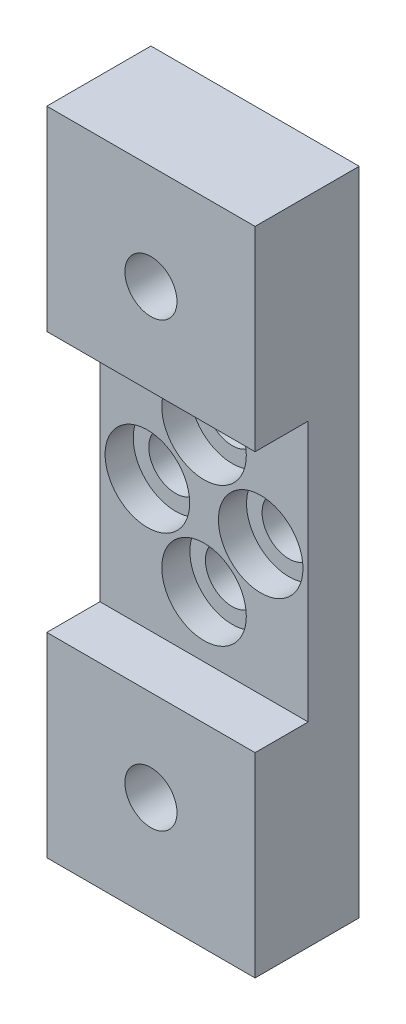
ISO-10303-21;
HEADER;
FILE_DESCRIPTION(('STEP AP214'),'2;1');
FILE_NAME('part.step','',(''),(''),'','','');
FILE_SCHEMA(('AUTOMOTIVE_DESIGN { 1 0 10303 214 1 1 1 1 }'));
ENDSEC;
DATA;
#1=APPLICATION_CONTEXT('core data for automotive mechanical design processes');
#2=APPLICATION_PROTOCOL_DEFINITION('international standard','automotive_design',2000,#1);
#3=PRODUCT_CONTEXT('',#1,'mechanical');
#4=PRODUCT('Part','Part','',(#3));
#5=PRODUCT_RELATED_PRODUCT_CATEGORY('part','',(#4));
#6=PRODUCT_DEFINITION_FORMATION('','',#4);
#7=PRODUCT_DEFINITION_CONTEXT('part definition',#1,'design');
#8=PRODUCT_DEFINITION('design','',#6,#7);
#9=PRODUCT_DEFINITION_SHAPE('','',#8);
#10=(LENGTH_UNIT() NAMED_UNIT(*) SI_UNIT(.MILLI.,.METRE.));
#11=(NAMED_UNIT(*) PLANE_ANGLE_UNIT() SI_UNIT($,.RADIAN.));
#12=(NAMED_UNIT(*) SI_UNIT($,.STERADIAN.) SOLID_ANGLE_UNIT());
#13=UNCERTAINTY_MEASURE_WITH_UNIT(LENGTH_MEASURE(1.E-05),#10,'distance_accuracy_value','');
#14=(GEOMETRIC_REPRESENTATION_CONTEXT(3) GLOBAL_UNCERTAINTY_ASSIGNED_CONTEXT((#13)) GLOBAL_UNIT_ASSIGNED_CONTEXT((#10,
#11,#12)) REPRESENTATION_CONTEXT('',''));
#15=CARTESIAN_POINT('',(0.,0.,0.));
#16=DIRECTION('',(0.,0.,1.));
#17=DIRECTION('',(1.,0.,0.));
#18=AXIS2_PLACEMENT_3D('',#15,#16,#17);
#19=CARTESIAN_POINT('',(-23.9833360824742,2.05986540664375,0.));
#20=DIRECTION('',(0.,0.,1.));
#21=DIRECTION('',(1.,0.,0.));
#22=AXIS2_PLACEMENT_3D('',#19,#20,#21);
#23=CYLINDRICAL_SURFACE('',#22,3.2639);
#24=CARTESIAN_POINT('',(-23.9833360824742,2.05986540664375,0.));
#25=DIRECTION('',(0.,0.,1.));
#26=DIRECTION('',(1.,0.,0.));
#27=AXIS2_PLACEMENT_3D('',#24,#25,#26);
#28=CIRCLE('',#27,3.2639);
#29=CARTESIAN_POINT('',(-20.7194360824742,2.05986540664375,0.));
#30=VERTEX_POINT('',#29);
#31=EDGE_CURVE('E218',#30,#30,#28,.T.);
#32=ORIENTED_EDGE('',*,*,#31,.F.);
#33=EDGE_LOOP('',(#32));
#34=FACE_BOUND('',#33,.T.);
#35=CARTESIAN_POINT('',(-23.9833360824742,2.05986540664375,2.794));
#36=DIRECTION('',(0.,0.,1.));
#37=DIRECTION('',(1.,0.,0.));
#38=AXIS2_PLACEMENT_3D('',#35,#36,#37);
#39=CIRCLE('',#38,3.2639);
#40=CARTESIAN_POINT('',(-20.7194360824742,2.05986540664375,2.794));
#41=VERTEX_POINT('',#40);
#42=EDGE_CURVE('E36',#41,#41,#39,.F.);
#43=ORIENTED_EDGE('',*,*,#42,.F.);
#44=EDGE_LOOP('',(#43));
#45=FACE_BOUND('',#44,.T.);
#46=ADVANCED_FACE('F32',(#34,#45),#23,.F.);
#47=CARTESIAN_POINT('',(-17.0745360824742,-6.43643459335625,0.));
#48=DIRECTION('',(0.,0.,1.));
#49=DIRECTION('',(1.,0.,0.));
#50=AXIS2_PLACEMENT_3D('',#47,#48,#49);
#51=CYLINDRICAL_SURFACE('',#50,3.2639);
#52=CARTESIAN_POINT('',(-17.0745360824742,-6.43643459335625,0.));
#53=DIRECTION('',(0.,0.,1.));
#54=DIRECTION('',(1.,0.,0.));
#55=AXIS2_PLACEMENT_3D('',#52,#53,#54);
#56=CIRCLE('',#55,3.2639);
#57=CARTESIAN_POINT('',(-13.8106360824742,-6.43643459335625,0.));
#58=VERTEX_POINT('',#57);
#59=EDGE_CURVE('E210',#58,#58,#56,.T.);
#60=ORIENTED_EDGE('',*,*,#59,.F.);
#61=EDGE_LOOP('',(#60));
#62=FACE_BOUND('',#61,.T.);
#63=CARTESIAN_POINT('',(-17.0745360824742,-6.43643459335625,2.794));
#64=DIRECTION('',(0.,0.,1.));
#65=DIRECTION('',(1.,0.,0.));
#66=AXIS2_PLACEMENT_3D('',#63,#64,#65);
#67=CIRCLE('',#66,3.2639);
#68=CARTESIAN_POINT('',(-13.8106360824742,-6.43643459335625,2.794));
#69=VERTEX_POINT('',#68);
#70=EDGE_CURVE('E176',#69,#69,#67,.F.);
#71=ORIENTED_EDGE('',*,*,#70,.F.);
#72=EDGE_LOOP('',(#71));
#73=FACE_BOUND('',#72,.T.);
#74=ADVANCED_FACE('F251',(#62,#73),#51,.F.);
#75=CARTESIAN_POINT('',(-10.1657360824742,2.05986540664375,0.));
#76=DIRECTION('',(0.,0.,1.));
#77=DIRECTION('',(1.,0.,0.));
#78=AXIS2_PLACEMENT_3D('',#75,#76,#77);
#79=CYLINDRICAL_SURFACE('',#78,3.2639);
#80=CARTESIAN_POINT('',(-10.1657360824742,2.05986540664375,0.));
#81=DIRECTION('',(0.,0.,1.));
#82=DIRECTION('',(1.,0.,0.));
#83=AXIS2_PLACEMENT_3D('',#80,#81,#82);
#84=CIRCLE('',#83,3.2639);
#85=CARTESIAN_POINT('',(-6.90183608247422,2.05986540664375,0.));
#86=VERTEX_POINT('',#85);
#87=EDGE_CURVE('E215',#86,#86,#84,.T.);
#88=ORIENTED_EDGE('',*,*,#87,.F.);
#89=EDGE_LOOP('',(#88));
#90=FACE_BOUND('',#89,.T.);
#91=CARTESIAN_POINT('',(-10.1657360824742,2.05986540664375,2.794));
#92=DIRECTION('',(0.,0.,1.));
#93=DIRECTION('',(1.,0.,0.));
#94=AXIS2_PLACEMENT_3D('',#91,#92,#93);
#95=CIRCLE('',#94,3.2639);
#96=CARTESIAN_POINT('',(-6.90183608247422,2.05986540664375,2.794));
#97=VERTEX_POINT('',#96);
#98=EDGE_CURVE('E172',#97,#97,#95,.F.);
#99=ORIENTED_EDGE('',*,*,#98,.F.);
#100=EDGE_LOOP('',(#99));
#101=FACE_BOUND('',#100,.T.);
#102=ADVANCED_FACE('F229',(#90,#101),#79,.F.);
#103=CARTESIAN_POINT('',(-17.0745360824742,10.5561654066437,0.));
#104=DIRECTION('',(0.,0.,1.));
#105=DIRECTION('',(1.,0.,0.));
#106=AXIS2_PLACEMENT_3D('',#103,#104,#105);
#107=CYLINDRICAL_SURFACE('',#106,3.2639);
#108=CARTESIAN_POINT('',(-17.0745360824742,10.5561654066437,0.));
#109=DIRECTION('',(0.,0.,1.));
#110=DIRECTION('',(1.,0.,0.));
#111=AXIS2_PLACEMENT_3D('',#108,#109,#110);
#112=CIRCLE('',#111,3.2639);
#113=CARTESIAN_POINT('',(-13.8106360824742,10.5561654066437,0.));
#114=VERTEX_POINT('',#113);
#115=EDGE_CURVE('E136',#114,#114,#112,.T.);
#116=ORIENTED_EDGE('',*,*,#115,.F.);
#117=EDGE_LOOP('',(#116));
#118=FACE_BOUND('',#117,.T.);
#119=CARTESIAN_POINT('',(-17.0745360824742,10.5561654066437,2.794));
#120=DIRECTION('',(0.,0.,1.));
#121=DIRECTION('',(1.,0.,0.));
#122=AXIS2_PLACEMENT_3D('',#119,#120,#121);
#123=CIRCLE('',#122,3.2639);
#124=CARTESIAN_POINT('',(-13.8106360824742,10.5561654066437,2.794));
#125=VERTEX_POINT('',#124);
#126=EDGE_CURVE('E167',#125,#125,#123,.F.);
#127=ORIENTED_EDGE('',*,*,#126,.F.);
#128=EDGE_LOOP('',(#127));
#129=FACE_BOUND('',#128,.T.);
#130=ADVANCED_FACE('F226',(#118,#129),#107,.F.);
#131=CARTESIAN_POINT('',(-29.7745360824742,41.7473654066437,12.7));
#132=DIRECTION('',(1.,0.,0.));
#133=DIRECTION('',(0.,1.,0.));
#134=AXIS2_PLACEMENT_3D('',#131,#132,#133);
#135=PLANE('',#134);
#136=DIRECTION('',(0.,0.,1.));
#137=VECTOR('',#136,1.);
#138=CARTESIAN_POINT('',(-29.7745360824742,17.9475654066438,6.223));
#139=LINE('',#138,#137);
#140=CARTESIAN_POINT('',(-29.7745360824742,17.9475654066438,6.223));
#141=VERTEX_POINT('',#140);
#142=CARTESIAN_POINT('',(-29.7745360824742,17.9475654066438,12.7));
#143=VERTEX_POINT('',#142);
#144=EDGE_CURVE('E108',#141,#143,#139,.T.);
#145=ORIENTED_EDGE('',*,*,#144,.T.);
#146=DIRECTION('',(0.,-1.,0.));
#147=VECTOR('',#146,1.);
#148=CARTESIAN_POINT('',(-29.7745360824742,41.7473654066437,12.7));
#149=LINE('',#148,#147);
#150=CARTESIAN_POINT('',(-29.7745360824742,41.7473654066437,12.7));
#151=VERTEX_POINT('',#150);
#152=EDGE_CURVE('E145',#151,#143,#149,.T.);
#153=ORIENTED_EDGE('',*,*,#152,.F.);
#154=DIRECTION('',(0.,0.,-1.));
#155=VECTOR('',#154,1.);
#156=CARTESIAN_POINT('',(-29.7745360824742,41.7473654066437,12.7));
#157=LINE('',#156,#155);
#158=CARTESIAN_POINT('',(-29.7745360824742,41.7473654066437,0.));
#159=VERTEX_POINT('',#158);
#160=EDGE_CURVE('E154',#151,#159,#157,.T.);
#161=ORIENTED_EDGE('',*,*,#160,.T.);
#162=DIRECTION('',(0.,-1.,0.));
#163=VECTOR('',#162,1.);
#164=CARTESIAN_POINT('',(-29.7745360824742,41.7473654066437,0.));
#165=LINE('',#164,#163);
#166=CARTESIAN_POINT('',(-29.7745360824742,-37.6276345933563,0.));
#167=VERTEX_POINT('',#166);
#168=EDGE_CURVE('E140',#159,#167,#165,.T.);
#169=ORIENTED_EDGE('',*,*,#168,.T.);
#170=DIRECTION('',(0.,0.,-1.));
#171=VECTOR('',#170,1.);
#172=CARTESIAN_POINT('',(-29.7745360824742,-37.6276345933563,12.7));
#173=LINE('',#172,#171);
#174=CARTESIAN_POINT('',(-29.7745360824742,-37.6276345933563,12.7));
#175=VERTEX_POINT('',#174);
#176=EDGE_CURVE('E11',#175,#167,#173,.T.);
#177=ORIENTED_EDGE('',*,*,#176,.F.);
#178=CARTESIAN_POINT('',(-29.7745360824742,-13.8278345933562,12.7));
#179=VERTEX_POINT('',#178);
#180=EDGE_CURVE('E86',#179,#175,#149,.T.);
#181=ORIENTED_EDGE('',*,*,#180,.F.);
#182=DIRECTION('',(0.,0.,1.));
#183=VECTOR('',#182,1.);
#184=CARTESIAN_POINT('',(-29.7745360824742,-13.8278345933563,6.223));
#185=LINE('',#184,#183);
#186=CARTESIAN_POINT('',(-29.7745360824742,-13.8278345933563,6.223));
#187=VERTEX_POINT('',#186);
#188=EDGE_CURVE('E49',#187,#179,#185,.T.);
#189=ORIENTED_EDGE('',*,*,#188,.F.);
#190=DIRECTION('',(0.,-1.,0.));
#191=VECTOR('',#190,1.);
#192=CARTESIAN_POINT('',(-29.7745360824742,0.,6.223));
#193=LINE('',#192,#191);
#194=EDGE_CURVE('E124',#141,#187,#193,.T.);
#195=ORIENTED_EDGE('',*,*,#194,.F.);
#196=EDGE_LOOP('',(#145,#153,#161,#169,#177,#181,#189,#195));
#197=FACE_BOUND('',#196,.T.);
#198=ADVANCED_FACE('F34',(#197),#135,.F.);
#199=CARTESIAN_POINT('',(-4.37453608247424,41.7473654066437,12.7));
#200=DIRECTION('',(-1.,0.,0.));
#201=DIRECTION('',(0.,-1.,0.));
#202=AXIS2_PLACEMENT_3D('',#199,#200,#201);
#203=PLANE('',#202);
#204=DIRECTION('',(0.,0.,1.));
#205=VECTOR('',#204,1.);
#206=CARTESIAN_POINT('',(-4.37453608247423,17.9475654066438,6.223));
#207=LINE('',#206,#205);
#208=CARTESIAN_POINT('',(-4.37453608247423,17.9475654066438,6.223));
#209=VERTEX_POINT('',#208);
#210=CARTESIAN_POINT('',(-4.37453608247423,17.9475654066438,12.7));
#211=VERTEX_POINT('',#210);
#212=EDGE_CURVE('E138',#209,#211,#207,.T.);
#213=ORIENTED_EDGE('',*,*,#212,.F.);
#214=DIRECTION('',(0.,1.,0.));
#215=VECTOR('',#214,1.);
#216=CARTESIAN_POINT('',(-4.37453608247423,0.,6.223));
#217=LINE('',#216,#215);
#218=CARTESIAN_POINT('',(-4.37453608247422,-13.8278345933563,6.223));
#219=VERTEX_POINT('',#218);
#220=EDGE_CURVE('E118',#219,#209,#217,.T.);
#221=ORIENTED_EDGE('',*,*,#220,.F.);
#222=DIRECTION('',(0.,0.,1.));
#223=VECTOR('',#222,1.);
#224=CARTESIAN_POINT('',(-4.37453608247422,-13.8278345933563,6.223));
#225=LINE('',#224,#223);
#226=CARTESIAN_POINT('',(-4.37453608247422,-13.8278345933563,12.7));
#227=VERTEX_POINT('',#226);
#228=EDGE_CURVE('E141',#219,#227,#225,.T.);
#229=ORIENTED_EDGE('',*,*,#228,.T.);
#230=DIRECTION('',(0.,1.,0.));
#231=VECTOR('',#230,1.);
#232=CARTESIAN_POINT('',(-4.37453608247424,41.7473654066437,12.7));
#233=LINE('',#232,#231);
#234=CARTESIAN_POINT('',(-4.37453608247422,-37.6276345933563,12.7));
#235=VERTEX_POINT('',#234);
#236=EDGE_CURVE('E150',#235,#227,#233,.T.);
#237=ORIENTED_EDGE('',*,*,#236,.F.);
#238=DIRECTION('',(0.,0.,-1.));
#239=VECTOR('',#238,1.);
#240=CARTESIAN_POINT('',(-4.37453608247422,-37.6276345933563,12.7));
#241=LINE('',#240,#239);
#242=CARTESIAN_POINT('',(-4.37453608247422,-37.6276345933563,0.));
#243=VERTEX_POINT('',#242);
#244=EDGE_CURVE('E41',#235,#243,#241,.T.);
#245=ORIENTED_EDGE('',*,*,#244,.T.);
#246=DIRECTION('',(0.,1.,0.));
#247=VECTOR('',#246,1.);
#248=CARTESIAN_POINT('',(-4.37453608247424,41.7473654066437,0.));
#249=LINE('',#248,#247);
#250=CARTESIAN_POINT('',(-4.37453608247424,41.7473654066437,0.));
#251=VERTEX_POINT('',#250);
#252=EDGE_CURVE('E159',#243,#251,#249,.T.);
#253=ORIENTED_EDGE('',*,*,#252,.T.);
#254=DIRECTION('',(0.,0.,-1.));
#255=VECTOR('',#254,1.);
#256=CARTESIAN_POINT('',(-4.37453608247424,41.7473654066437,12.7));
#257=LINE('',#256,#255);
#258=CARTESIAN_POINT('',(-4.37453608247424,41.7473654066437,12.7));
#259=VERTEX_POINT('',#258);
#260=EDGE_CURVE('E163',#259,#251,#257,.T.);
#261=ORIENTED_EDGE('',*,*,#260,.F.);
#262=EDGE_CURVE('E149',#211,#259,#233,.T.);
#263=ORIENTED_EDGE('',*,*,#262,.F.);
#264=EDGE_LOOP('',(#213,#221,#229,#237,#245,#253,#261,#263));
#265=FACE_BOUND('',#264,.T.);
#266=ADVANCED_FACE('F283',(#265),#203,.F.);
#267=CARTESIAN_POINT('',(-29.7745360824742,-37.6276345933563,12.7));
#268=DIRECTION('',(0.,0.,1.));
#269=DIRECTION('',(1.,0.,0.));
#270=AXIS2_PLACEMENT_3D('',#267,#268,#269);
#271=PLANE('',#270);
#272=CARTESIAN_POINT('',(-17.0745360824742,29.0473654066437,12.7));
#273=DIRECTION('',(0.,0.,1.));
#274=DIRECTION('',(1.,0.,0.));
#275=AXIS2_PLACEMENT_3D('',#272,#273,#274);
#276=CIRCLE('',#275,3.175);
#277=CARTESIAN_POINT('',(-13.8995360824742,29.0473654066437,12.7));
#278=VERTEX_POINT('',#277);
#279=EDGE_CURVE('E170',#278,#278,#276,.T.);
#280=ORIENTED_EDGE('',*,*,#279,.F.);
#281=EDGE_LOOP('',(#280));
#282=FACE_BOUND('',#281,.T.);
#283=ORIENTED_EDGE('',*,*,#152,.T.);
#284=DIRECTION('',(1.,0.,0.));
#285=VECTOR('',#284,1.);
#286=CARTESIAN_POINT('',(0.,17.9475654066438,12.7));
#287=LINE('',#286,#285);
#288=EDGE_CURVE('E114',#143,#211,#287,.T.);
#289=ORIENTED_EDGE('',*,*,#288,.T.);
#290=ORIENTED_EDGE('',*,*,#262,.T.);
#291=DIRECTION('',(-1.,0.,0.));
#292=VECTOR('',#291,1.);
#293=CARTESIAN_POINT('',(-29.7745360824742,41.7473654066437,12.7));
#294=LINE('',#293,#292);
#295=EDGE_CURVE('E58',#259,#151,#294,.T.);
#296=ORIENTED_EDGE('',*,*,#295,.T.);
#297=EDGE_LOOP('',(#283,#289,#290,#296));
#298=FACE_BOUND('',#297,.T.);
#299=ADVANCED_FACE('F276',(#282,#298),#271,.T.);
#300=CARTESIAN_POINT('',(-29.7745360824742,-37.6276345933563,12.7));
#301=DIRECTION('',(0.,1.,0.));
#302=DIRECTION('',(0.,0.,1.));
#303=AXIS2_PLACEMENT_3D('',#300,#301,#302);
#304=PLANE('',#303);
#305=DIRECTION('',(1.,0.,0.));
#306=VECTOR('',#305,1.);
#307=CARTESIAN_POINT('',(-29.7745360824742,-37.6276345933563,0.));
#308=LINE('',#307,#306);
#309=EDGE_CURVE('E157',#167,#243,#308,.T.);
#310=ORIENTED_EDGE('',*,*,#309,.T.);
#311=ORIENTED_EDGE('',*,*,#244,.F.);
#312=DIRECTION('',(1.,0.,0.));
#313=VECTOR('',#312,1.);
#314=CARTESIAN_POINT('',(-29.7745360824742,-37.6276345933563,12.7));
#315=LINE('',#314,#313);
#316=EDGE_CURVE('E147',#175,#235,#315,.T.);
#317=ORIENTED_EDGE('',*,*,#316,.F.);
#318=ORIENTED_EDGE('',*,*,#176,.T.);
#319=EDGE_LOOP('',(#310,#311,#317,#318));
#320=FACE_BOUND('',#319,.T.);
#321=ADVANCED_FACE('F282',(#320),#304,.F.);
#322=CARTESIAN_POINT('',(-29.7745360824742,41.7473654066437,12.7));
#323=DIRECTION('',(0.,-1.,0.));
#324=DIRECTION('',(0.,0.,-1.));
#325=AXIS2_PLACEMENT_3D('',#322,#323,#324);
#326=PLANE('',#325);
#327=DIRECTION('',(-1.,0.,0.));
#328=VECTOR('',#327,1.);
#329=CARTESIAN_POINT('',(-29.7745360824742,41.7473654066437,0.));
#330=LINE('',#329,#328);
#331=EDGE_CURVE('E79',#251,#159,#330,.T.);
#332=ORIENTED_EDGE('',*,*,#331,.T.);
#333=ORIENTED_EDGE('',*,*,#160,.F.);
#334=ORIENTED_EDGE('',*,*,#295,.F.);
#335=ORIENTED_EDGE('',*,*,#260,.T.);
#336=EDGE_LOOP('',(#332,#333,#334,#335));
#337=FACE_BOUND('',#336,.T.);
#338=ADVANCED_FACE('F274',(#337),#326,.F.);
#339=CARTESIAN_POINT('',(-17.0745360824742,-24.9276345933563,12.7));
#340=DIRECTION('',(0.,0.,1.));
#341=DIRECTION('',(1.,0.,0.));
#342=AXIS2_PLACEMENT_3D('',#339,#340,#341);
#343=CIRCLE('',#342,3.175);
#344=CARTESIAN_POINT('',(-13.8995360824742,-24.9276345933563,12.7));
#345=VERTEX_POINT('',#344);
#346=EDGE_CURVE('E204',#345,#345,#343,.T.);
#347=ORIENTED_EDGE('',*,*,#346,.F.);
#348=EDGE_LOOP('',(#347));
#349=FACE_BOUND('',#348,.T.);
#350=DIRECTION('',(1.,0.,0.));
#351=VECTOR('',#350,1.);
#352=CARTESIAN_POINT('',(0.,-13.8278345933563,12.7));
#353=LINE('',#352,#351);
#354=EDGE_CURVE('E127',#179,#227,#353,.T.);
#355=ORIENTED_EDGE('',*,*,#354,.F.);
#356=ORIENTED_EDGE('',*,*,#180,.T.);
#357=ORIENTED_EDGE('',*,*,#316,.T.);
#358=ORIENTED_EDGE('',*,*,#236,.T.);
#359=EDGE_LOOP('',(#355,#356,#357,#358));
#360=FACE_BOUND('',#359,.T.);
#361=ADVANCED_FACE('F271',(#349,#360),#271,.T.);
#362=CARTESIAN_POINT('',(-29.7745360824742,-37.6276345933563,0.));
#363=DIRECTION('',(0.,0.,1.));
#364=DIRECTION('',(1.,0.,0.));
#365=AXIS2_PLACEMENT_3D('',#362,#363,#364);
#366=PLANE('',#365);
#367=CARTESIAN_POINT('',(-17.0745360824742,29.0473654066437,0.));
#368=DIRECTION('',(0.,0.,1.));
#369=DIRECTION('',(1.,0.,0.));
#370=AXIS2_PLACEMENT_3D('',#367,#368,#369);
#371=CIRCLE('',#370,3.175);
#372=CARTESIAN_POINT('',(-13.8995360824742,29.0473654066437,0.));
#373=VERTEX_POINT('',#372);
#374=EDGE_CURVE('E201',#373,#373,#371,.T.);
#375=ORIENTED_EDGE('',*,*,#374,.T.);
#376=EDGE_LOOP('',(#375));
#377=FACE_BOUND('',#376,.T.);
#378=CARTESIAN_POINT('',(-17.0745360824742,-24.9276345933563,0.));
#379=DIRECTION('',(0.,0.,1.));
#380=DIRECTION('',(1.,0.,0.));
#381=AXIS2_PLACEMENT_3D('',#378,#379,#380);
#382=CIRCLE('',#381,3.175);
#383=CARTESIAN_POINT('',(-13.8995360824742,-24.9276345933563,0.));
#384=VERTEX_POINT('',#383);
#385=EDGE_CURVE('E207',#384,#384,#382,.T.);
#386=ORIENTED_EDGE('',*,*,#385,.T.);
#387=EDGE_LOOP('',(#386));
#388=FACE_BOUND('',#387,.T.);
#389=ORIENTED_EDGE('',*,*,#59,.T.);
#390=EDGE_LOOP('',(#389));
#391=FACE_BOUND('',#390,.T.);
#392=ORIENTED_EDGE('',*,*,#87,.T.);
#393=EDGE_LOOP('',(#392));
#394=FACE_BOUND('',#393,.T.);
#395=ORIENTED_EDGE('',*,*,#31,.T.);
#396=EDGE_LOOP('',(#395));
#397=FACE_BOUND('',#396,.T.);
#398=ORIENTED_EDGE('',*,*,#115,.T.);
#399=EDGE_LOOP('',(#398));
#400=FACE_BOUND('',#399,.T.);
#401=ORIENTED_EDGE('',*,*,#168,.F.);
#402=ORIENTED_EDGE('',*,*,#331,.F.);
#403=ORIENTED_EDGE('',*,*,#252,.F.);
#404=ORIENTED_EDGE('',*,*,#309,.F.);
#405=EDGE_LOOP('',(#401,#402,#403,#404));
#406=FACE_BOUND('',#405,.T.);
#407=ADVANCED_FACE('F223',(#377,#388,#391,#394,#397,#400,#406),#366,.F.);
#408=CARTESIAN_POINT('',(0.,17.9475654066438,6.223));
#409=DIRECTION('',(0.,-1.,0.));
#410=DIRECTION('',(0.,0.,-1.));
#411=AXIS2_PLACEMENT_3D('',#408,#409,#410);
#412=PLANE('',#411);
#413=ORIENTED_EDGE('',*,*,#288,.F.);
#414=ORIENTED_EDGE('',*,*,#144,.F.);
#415=DIRECTION('',(1.,0.,0.));
#416=VECTOR('',#415,1.);
#417=CARTESIAN_POINT('',(0.,17.9475654066438,6.223));
#418=LINE('',#417,#416);
#419=EDGE_CURVE('E111',#141,#209,#418,.T.);
#420=ORIENTED_EDGE('',*,*,#419,.T.);
#421=ORIENTED_EDGE('',*,*,#212,.T.);
#422=EDGE_LOOP('',(#413,#414,#420,#421));
#423=FACE_BOUND('',#422,.T.);
#424=ADVANCED_FACE('F110',(#423),#412,.T.);
#425=CARTESIAN_POINT('',(0.,-13.8278345933563,6.223));
#426=DIRECTION('',(0.,-1.,0.));
#427=DIRECTION('',(0.,0.,-1.));
#428=AXIS2_PLACEMENT_3D('',#425,#426,#427);
#429=PLANE('',#428);
#430=ORIENTED_EDGE('',*,*,#354,.T.);
#431=ORIENTED_EDGE('',*,*,#228,.F.);
#432=DIRECTION('',(1.,0.,0.));
#433=VECTOR('',#432,1.);
#434=CARTESIAN_POINT('',(0.,-13.8278345933563,6.223));
#435=LINE('',#434,#433);
#436=EDGE_CURVE('E129',#187,#219,#435,.T.);
#437=ORIENTED_EDGE('',*,*,#436,.F.);
#438=ORIENTED_EDGE('',*,*,#188,.T.);
#439=EDGE_LOOP('',(#430,#431,#437,#438));
#440=FACE_BOUND('',#439,.T.);
#441=ADVANCED_FACE('F265',(#440),#429,.F.);
#442=CARTESIAN_POINT('',(0.,0.,6.223));
#443=DIRECTION('',(0.,0.,1.));
#444=DIRECTION('',(1.,0.,0.));
#445=AXIS2_PLACEMENT_3D('',#442,#443,#444);
#446=PLANE('',#445);
#447=CARTESIAN_POINT('',(-23.9833360824742,2.05986540664375,6.223));
#448=DIRECTION('',(0.,0.,1.));
#449=DIRECTION('',(1.,0.,0.));
#450=AXIS2_PLACEMENT_3D('',#447,#448,#449);
#451=CIRCLE('',#450,5.1562);
#452=CARTESIAN_POINT('',(-18.8271360824742,2.05986540664375,6.223));
#453=VERTEX_POINT('',#452);
#454=EDGE_CURVE('E192',#453,#453,#451,.T.);
#455=ORIENTED_EDGE('',*,*,#454,.F.);
#456=EDGE_LOOP('',(#455));
#457=FACE_BOUND('',#456,.T.);
#458=CARTESIAN_POINT('',(-17.0745360824742,-6.43643459335625,6.223));
#459=DIRECTION('',(0.,0.,1.));
#460=DIRECTION('',(1.,0.,0.));
#461=AXIS2_PLACEMENT_3D('',#458,#459,#460);
#462=CIRCLE('',#461,5.1562);
#463=CARTESIAN_POINT('',(-11.9183360824742,-6.43643459335625,6.223));
#464=VERTEX_POINT('',#463);
#465=EDGE_CURVE('E185',#464,#464,#462,.T.);
#466=ORIENTED_EDGE('',*,*,#465,.F.);
#467=EDGE_LOOP('',(#466));
#468=FACE_BOUND('',#467,.T.);
#469=CARTESIAN_POINT('',(-10.1657360824742,2.05986540664375,6.223));
#470=DIRECTION('',(0.,0.,1.));
#471=DIRECTION('',(1.,0.,0.));
#472=AXIS2_PLACEMENT_3D('',#469,#470,#471);
#473=CIRCLE('',#472,5.1562);
#474=CARTESIAN_POINT('',(-5.00953608247422,2.05986540664375,6.223));
#475=VERTEX_POINT('',#474);
#476=EDGE_CURVE('E178',#475,#475,#473,.T.);
#477=ORIENTED_EDGE('',*,*,#476,.F.);
#478=EDGE_LOOP('',(#477));
#479=FACE_BOUND('',#478,.T.);
#480=CARTESIAN_POINT('',(-17.0745360824742,10.5561654066437,6.223));
#481=DIRECTION('',(0.,0.,1.));
#482=DIRECTION('',(1.,0.,0.));
#483=AXIS2_PLACEMENT_3D('',#480,#481,#482);
#484=CIRCLE('',#483,5.1562);
#485=CARTESIAN_POINT('',(-11.9183360824742,10.5561654066437,6.223));
#486=VERTEX_POINT('',#485);
#487=EDGE_CURVE('E174',#486,#486,#484,.T.);
#488=ORIENTED_EDGE('',*,*,#487,.F.);
#489=EDGE_LOOP('',(#488));
#490=FACE_BOUND('',#489,.T.);
#491=ORIENTED_EDGE('',*,*,#419,.F.);
#492=ORIENTED_EDGE('',*,*,#194,.T.);
#493=ORIENTED_EDGE('',*,*,#436,.T.);
#494=ORIENTED_EDGE('',*,*,#220,.T.);
#495=EDGE_LOOP('',(#491,#492,#493,#494));
#496=FACE_BOUND('',#495,.T.);
#497=ADVANCED_FACE('F122',(#457,#468,#479,#490,#496),#446,.T.);
#498=CARTESIAN_POINT('',(-17.0745360824742,-24.9276345933563,0.));
#499=DIRECTION('',(0.,0.,1.));
#500=DIRECTION('',(1.,0.,0.));
#501=AXIS2_PLACEMENT_3D('',#498,#499,#500);
#502=CYLINDRICAL_SURFACE('',#501,3.175);
#503=ORIENTED_EDGE('',*,*,#385,.F.);
#504=EDGE_LOOP('',(#503));
#505=FACE_BOUND('',#504,.T.);
#506=ORIENTED_EDGE('',*,*,#346,.T.);
#507=EDGE_LOOP('',(#506));
#508=FACE_BOUND('',#507,.T.);
#509=ADVANCED_FACE('F246',(#505,#508),#502,.F.);
#510=CARTESIAN_POINT('',(-17.0745360824742,29.0473654066437,0.));
#511=DIRECTION('',(0.,0.,1.));
#512=DIRECTION('',(1.,0.,0.));
#513=AXIS2_PLACEMENT_3D('',#510,#511,#512);
#514=CYLINDRICAL_SURFACE('',#513,3.175);
#515=ORIENTED_EDGE('',*,*,#374,.F.);
#516=EDGE_LOOP('',(#515));
#517=FACE_BOUND('',#516,.T.);
#518=ORIENTED_EDGE('',*,*,#279,.T.);
#519=EDGE_LOOP('',(#518));
#520=FACE_BOUND('',#519,.T.);
#521=ADVANCED_FACE('F236',(#517,#520),#514,.F.);
#522=CARTESIAN_POINT('',(-17.0745360824742,10.5561654066437,2.794));
#523=DIRECTION('',(0.,0.,1.));
#524=DIRECTION('',(1.,0.,0.));
#525=AXIS2_PLACEMENT_3D('',#522,#523,#524);
#526=PLANE('',#525);
#527=CARTESIAN_POINT('',(-17.0745360824742,10.5561654066437,2.794));
#528=DIRECTION('',(0.,0.,1.));
#529=DIRECTION('',(1.,0.,0.));
#530=AXIS2_PLACEMENT_3D('',#527,#528,#529);
#531=CIRCLE('',#530,5.1562);
#532=CARTESIAN_POINT('',(-11.9183360824742,10.5561654066437,2.794));
#533=VERTEX_POINT('',#532);
#534=EDGE_CURVE('E171',#533,#533,#531,.T.);
#535=ORIENTED_EDGE('',*,*,#534,.T.);
#536=EDGE_LOOP('',(#535));
#537=FACE_BOUND('',#536,.T.);
#538=ORIENTED_EDGE('',*,*,#126,.T.);
#539=EDGE_LOOP('',(#538));
#540=FACE_BOUND('',#539,.T.);
#541=ADVANCED_FACE('F233',(#537,#540),#526,.T.);
#542=CARTESIAN_POINT('',(-17.0745360824742,10.5561654066437,2.794));
#543=DIRECTION('',(0.,0.,1.));
#544=DIRECTION('',(1.,0.,0.));
#545=AXIS2_PLACEMENT_3D('',#542,#543,#544);
#546=CYLINDRICAL_SURFACE('',#545,5.1562);
#547=ORIENTED_EDGE('',*,*,#534,.F.);
#548=EDGE_LOOP('',(#547));
#549=FACE_BOUND('',#548,.T.);
#550=ORIENTED_EDGE('',*,*,#487,.T.);
#551=EDGE_LOOP('',(#550));
#552=FACE_BOUND('',#551,.T.);
#553=ADVANCED_FACE('F235',(#549,#552),#546,.F.);
#554=CARTESIAN_POINT('',(-10.1657360824742,2.05986540664375,2.794));
#555=DIRECTION('',(0.,0.,1.));
#556=DIRECTION('',(1.,0.,0.));
#557=AXIS2_PLACEMENT_3D('',#554,#555,#556);
#558=PLANE('',#557);
#559=CARTESIAN_POINT('',(-10.1657360824742,2.05986540664375,2.794));
#560=DIRECTION('',(0.,0.,1.));
#561=DIRECTION('',(1.,0.,0.));
#562=AXIS2_PLACEMENT_3D('',#559,#560,#561);
#563=CIRCLE('',#562,5.1562);
#564=CARTESIAN_POINT('',(-5.00953608247422,2.05986540664375,2.794));
#565=VERTEX_POINT('',#564);
#566=EDGE_CURVE('E175',#565,#565,#563,.T.);
#567=ORIENTED_EDGE('',*,*,#566,.T.);
#568=EDGE_LOOP('',(#567));
#569=FACE_BOUND('',#568,.T.);
#570=ORIENTED_EDGE('',*,*,#98,.T.);
#571=EDGE_LOOP('',(#570));
#572=FACE_BOUND('',#571,.T.);
#573=ADVANCED_FACE('F243',(#569,#572),#558,.T.);
#574=CARTESIAN_POINT('',(-10.1657360824742,2.05986540664375,2.794));
#575=DIRECTION('',(0.,0.,1.));
#576=DIRECTION('',(1.,0.,0.));
#577=AXIS2_PLACEMENT_3D('',#574,#575,#576);
#578=CYLINDRICAL_SURFACE('',#577,5.1562);
#579=ORIENTED_EDGE('',*,*,#566,.F.);
#580=EDGE_LOOP('',(#579));
#581=FACE_BOUND('',#580,.T.);
#582=ORIENTED_EDGE('',*,*,#476,.T.);
#583=EDGE_LOOP('',(#582));
#584=FACE_BOUND('',#583,.T.);
#585=ADVANCED_FACE('F400',(#581,#584),#578,.F.);
#586=CARTESIAN_POINT('',(-17.0745360824742,-6.43643459335625,2.794));
#587=DIRECTION('',(0.,0.,1.));
#588=DIRECTION('',(1.,0.,0.));
#589=AXIS2_PLACEMENT_3D('',#586,#587,#588);
#590=PLANE('',#589);
#591=CARTESIAN_POINT('',(-17.0745360824742,-6.43643459335625,2.794));
#592=DIRECTION('',(0.,0.,1.));
#593=DIRECTION('',(1.,0.,0.));
#594=AXIS2_PLACEMENT_3D('',#591,#592,#593);
#595=CIRCLE('',#594,5.1562);
#596=CARTESIAN_POINT('',(-11.9183360824742,-6.43643459335625,2.794));
#597=VERTEX_POINT('',#596);
#598=EDGE_CURVE('E179',#597,#597,#595,.T.);
#599=ORIENTED_EDGE('',*,*,#598,.T.);
#600=EDGE_LOOP('',(#599));
#601=FACE_BOUND('',#600,.T.);
#602=ORIENTED_EDGE('',*,*,#70,.T.);
#603=EDGE_LOOP('',(#602));
#604=FACE_BOUND('',#603,.T.);
#605=ADVANCED_FACE('F410',(#601,#604),#590,.T.);
#606=CARTESIAN_POINT('',(-17.0745360824742,-6.43643459335625,2.794));
#607=DIRECTION('',(0.,0.,1.));
#608=DIRECTION('',(1.,0.,0.));
#609=AXIS2_PLACEMENT_3D('',#606,#607,#608);
#610=CYLINDRICAL_SURFACE('',#609,5.1562);
#611=ORIENTED_EDGE('',*,*,#598,.F.);
#612=EDGE_LOOP('',(#611));
#613=FACE_BOUND('',#612,.T.);
#614=ORIENTED_EDGE('',*,*,#465,.T.);
#615=EDGE_LOOP('',(#614));
#616=FACE_BOUND('',#615,.T.);
#617=ADVANCED_FACE('F419',(#613,#616),#610,.F.);
#618=CARTESIAN_POINT('',(-23.9833360824742,2.05986540664375,2.794));
#619=DIRECTION('',(0.,0.,1.));
#620=DIRECTION('',(1.,0.,0.));
#621=AXIS2_PLACEMENT_3D('',#618,#619,#620);
#622=PLANE('',#621);
#623=CARTESIAN_POINT('',(-23.9833360824742,2.05986540664375,2.794));
#624=DIRECTION('',(0.,0.,1.));
#625=DIRECTION('',(1.,0.,0.));
#626=AXIS2_PLACEMENT_3D('',#623,#624,#625);
#627=CIRCLE('',#626,5.1562);
#628=CARTESIAN_POINT('',(-18.8271360824742,2.05986540664375,2.794));
#629=VERTEX_POINT('',#628);
#630=EDGE_CURVE('E455',#629,#629,#627,.T.);
#631=ORIENTED_EDGE('',*,*,#630,.T.);
#632=EDGE_LOOP('',(#631));
#633=FACE_BOUND('',#632,.T.);
#634=ORIENTED_EDGE('',*,*,#42,.T.);
#635=EDGE_LOOP('',(#634));
#636=FACE_BOUND('',#635,.T.);
#637=ADVANCED_FACE('F428',(#633,#636),#622,.T.);
#638=CARTESIAN_POINT('',(-23.9833360824742,2.05986540664375,2.794));
#639=DIRECTION('',(0.,0.,1.));
#640=DIRECTION('',(1.,0.,0.));
#641=AXIS2_PLACEMENT_3D('',#638,#639,#640);
#642=CYLINDRICAL_SURFACE('',#641,5.1562);
#643=ORIENTED_EDGE('',*,*,#630,.F.);
#644=EDGE_LOOP('',(#643));
#645=FACE_BOUND('',#644,.T.);
#646=ORIENTED_EDGE('',*,*,#454,.T.);
#647=EDGE_LOOP('',(#646));
#648=FACE_BOUND('',#647,.T.);
#649=ADVANCED_FACE('F438',(#645,#648),#642,.F.);
#650=CLOSED_SHELL('',(#46,#74,#102,#130,#198,#266,#299,#321,#338,#361,#407,#424,#441,#497,#509,
#521,#541,#553,#573,#585,#605,#617,#637,#649));
#651=MANIFOLD_SOLID_BREP('B2',#650);
#652=ADVANCED_BREP_SHAPE_REPRESENTATION('',(#18,#651),#14);
#653=SHAPE_DEFINITION_REPRESENTATION(#9,#652);
ENDSEC;
END-ISO-10303-21;
